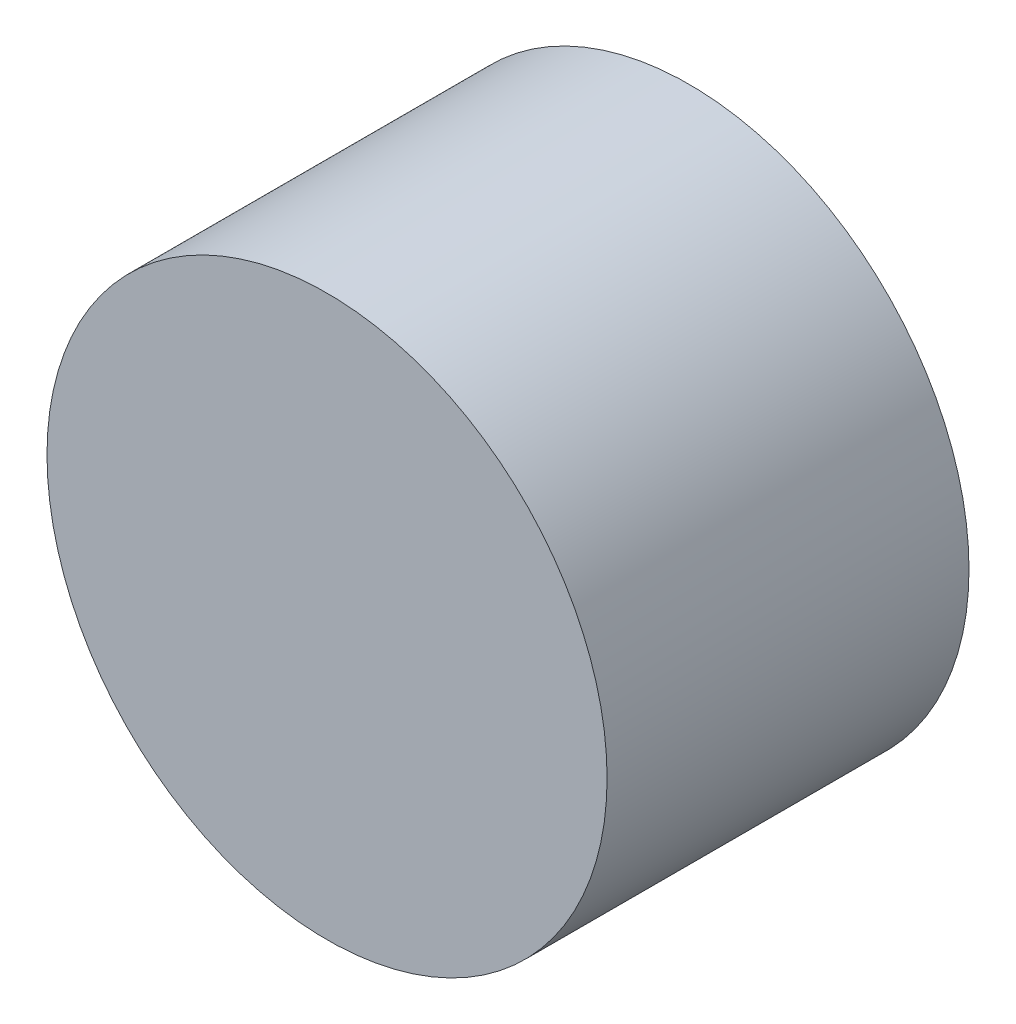
ISO-10303-21;
HEADER;
FILE_DESCRIPTION(('STEP AP214'),'2;1');
FILE_NAME('part.step','',(''),(''),'','','');
FILE_SCHEMA(('AUTOMOTIVE_DESIGN { 1 0 10303 214 1 1 1 1 }'));
ENDSEC;
DATA;
#1=APPLICATION_CONTEXT('core data for automotive mechanical design processes');
#2=APPLICATION_PROTOCOL_DEFINITION('international standard','automotive_design',2000,#1);
#3=PRODUCT_CONTEXT('',#1,'mechanical');
#4=PRODUCT('Part','Part','',(#3));
#5=PRODUCT_RELATED_PRODUCT_CATEGORY('part','',(#4));
#6=PRODUCT_DEFINITION_FORMATION('','',#4);
#7=PRODUCT_DEFINITION_CONTEXT('part definition',#1,'design');
#8=PRODUCT_DEFINITION('design','',#6,#7);
#9=PRODUCT_DEFINITION_SHAPE('','',#8);
#10=(LENGTH_UNIT() NAMED_UNIT(*) SI_UNIT(.MILLI.,.METRE.));
#11=(NAMED_UNIT(*) PLANE_ANGLE_UNIT() SI_UNIT($,.RADIAN.));
#12=(NAMED_UNIT(*) SI_UNIT($,.STERADIAN.) SOLID_ANGLE_UNIT());
#13=UNCERTAINTY_MEASURE_WITH_UNIT(LENGTH_MEASURE(1.E-05),#10,'distance_accuracy_value','');
#14=(GEOMETRIC_REPRESENTATION_CONTEXT(3) GLOBAL_UNCERTAINTY_ASSIGNED_CONTEXT((#13)) GLOBAL_UNIT_ASSIGNED_CONTEXT((#10,
#11,#12)) REPRESENTATION_CONTEXT('',''));
#15=CARTESIAN_POINT('',(0.,0.,0.));
#16=DIRECTION('',(0.,0.,1.));
#17=DIRECTION('',(1.,0.,0.));
#18=AXIS2_PLACEMENT_3D('',#15,#16,#17);
#19=CARTESIAN_POINT('',(0.,0.,42.));
#20=DIRECTION('',(0.,0.,-1.));
#21=DIRECTION('',(-1.,0.,0.));
#22=AXIS2_PLACEMENT_3D('',#19,#20,#21);
#23=CYLINDRICAL_SURFACE('',#22,32.5);
#24=CARTESIAN_POINT('',(0.,0.,42.));
#25=DIRECTION('',(0.,0.,1.));
#26=DIRECTION('',(1.,0.,0.));
#27=AXIS2_PLACEMENT_3D('',#24,#25,#26);
#28=CIRCLE('',#27,32.5);
#29=CARTESIAN_POINT('',(32.5,0.,42.));
#30=VERTEX_POINT('',#29);
#31=EDGE_CURVE('E10',#30,#30,#28,.T.);
#32=ORIENTED_EDGE('',*,*,#31,.F.);
#33=EDGE_LOOP('',(#32));
#34=FACE_BOUND('',#33,.T.);
#35=CARTESIAN_POINT('',(0.,0.,0.));
#36=DIRECTION('',(0.,0.,1.));
#37=DIRECTION('',(1.,0.,0.));
#38=AXIS2_PLACEMENT_3D('',#35,#36,#37);
#39=CIRCLE('',#38,32.5);
#40=CARTESIAN_POINT('',(32.5,0.,0.));
#41=VERTEX_POINT('',#40);
#42=EDGE_CURVE('E50',#41,#41,#39,.T.);
#43=ORIENTED_EDGE('',*,*,#42,.T.);
#44=EDGE_LOOP('',(#43));
#45=FACE_BOUND('',#44,.T.);
#46=ADVANCED_FACE('F47',(#34,#45),#23,.T.);
#47=CARTESIAN_POINT('',(0.,0.,42.));
#48=DIRECTION('',(0.,0.,1.));
#49=DIRECTION('',(1.,0.,0.));
#50=AXIS2_PLACEMENT_3D('',#47,#48,#49);
#51=PLANE('',#50);
#52=ORIENTED_EDGE('',*,*,#31,.T.);
#53=EDGE_LOOP('',(#52));
#54=FACE_BOUND('',#53,.T.);
#55=ADVANCED_FACE('F64',(#54),#51,.T.);
#56=CARTESIAN_POINT('',(0.,0.,0.));
#57=DIRECTION('',(0.,0.,1.));
#58=DIRECTION('',(1.,0.,0.));
#59=AXIS2_PLACEMENT_3D('',#56,#57,#58);
#60=PLANE('',#59);
#61=ORIENTED_EDGE('',*,*,#42,.F.);
#62=EDGE_LOOP('',(#61));
#63=FACE_BOUND('',#62,.T.);
#64=ADVANCED_FACE('F62',(#63),#60,.F.);
#65=CLOSED_SHELL('',(#46,#55,#64));
#66=MANIFOLD_SOLID_BREP('B2',#65);
#67=ADVANCED_BREP_SHAPE_REPRESENTATION('',(#18,#66),#14);
#68=SHAPE_DEFINITION_REPRESENTATION(#9,#67);
ENDSEC;
END-ISO-10303-21;
